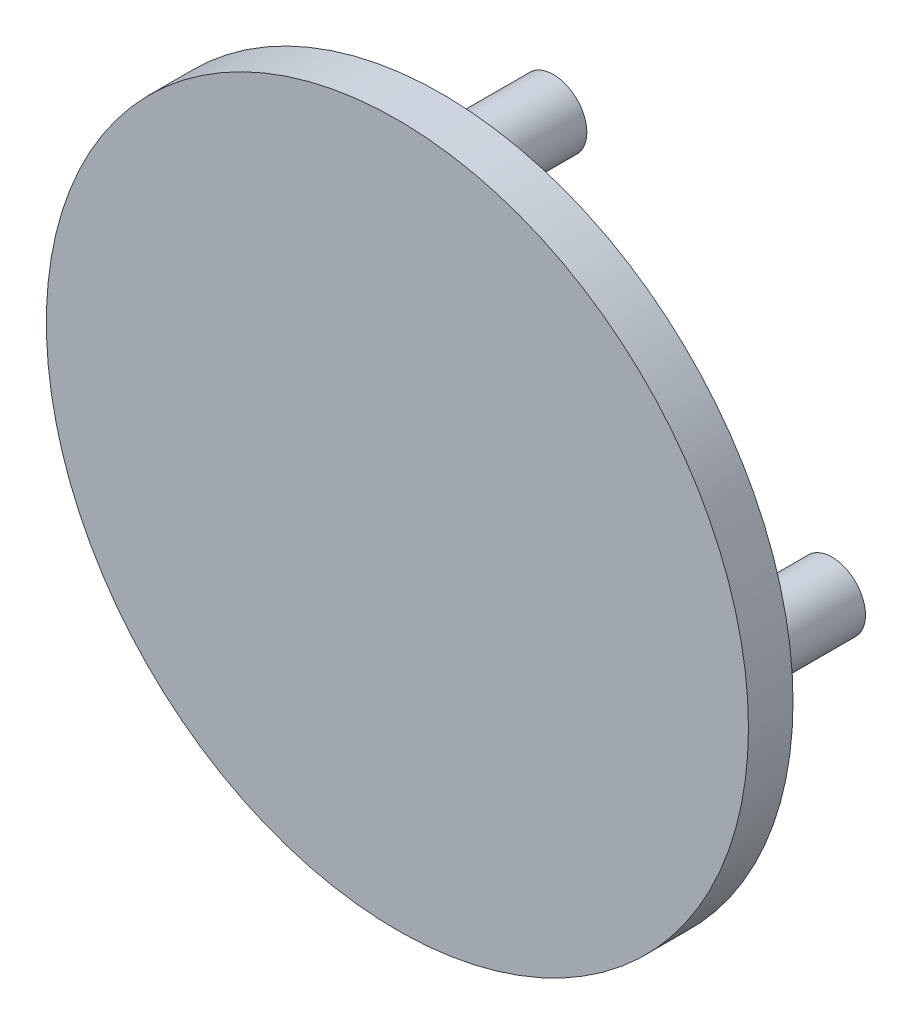
ISO-10303-21;
HEADER;
FILE_DESCRIPTION(('STEP AP214'),'2;1');
FILE_NAME('part.step','',(''),(''),'','','');
FILE_SCHEMA(('AUTOMOTIVE_DESIGN { 1 0 10303 214 1 1 1 1 }'));
ENDSEC;
DATA;
#1=APPLICATION_CONTEXT('core data for automotive mechanical design processes');
#2=APPLICATION_PROTOCOL_DEFINITION('international standard','automotive_design',2000,#1);
#3=PRODUCT_CONTEXT('',#1,'mechanical');
#4=PRODUCT('Part','Part','',(#3));
#5=PRODUCT_RELATED_PRODUCT_CATEGORY('part','',(#4));
#6=PRODUCT_DEFINITION_FORMATION('','',#4);
#7=PRODUCT_DEFINITION_CONTEXT('part definition',#1,'design');
#8=PRODUCT_DEFINITION('design','',#6,#7);
#9=PRODUCT_DEFINITION_SHAPE('','',#8);
#10=(LENGTH_UNIT() NAMED_UNIT(*) SI_UNIT(.MILLI.,.METRE.));
#11=(NAMED_UNIT(*) PLANE_ANGLE_UNIT() SI_UNIT($,.RADIAN.));
#12=(NAMED_UNIT(*) SI_UNIT($,.STERADIAN.) SOLID_ANGLE_UNIT());
#13=UNCERTAINTY_MEASURE_WITH_UNIT(LENGTH_MEASURE(1.E-05),#10,'distance_accuracy_value','');
#14=(GEOMETRIC_REPRESENTATION_CONTEXT(3) GLOBAL_UNCERTAINTY_ASSIGNED_CONTEXT((#13)) GLOBAL_UNIT_ASSIGNED_CONTEXT((#10,
#11,#12)) REPRESENTATION_CONTEXT('',''));
#15=CARTESIAN_POINT('',(0.,0.,0.));
#16=DIRECTION('',(0.,0.,1.));
#17=DIRECTION('',(1.,0.,0.));
#18=AXIS2_PLACEMENT_3D('',#15,#16,#17);
#19=CARTESIAN_POINT('',(0.,0.,8.));
#20=DIRECTION('',(0.,0.,-1.));
#21=DIRECTION('',(-1.,0.,0.));
#22=AXIS2_PLACEMENT_3D('',#19,#20,#21);
#23=CYLINDRICAL_SURFACE('',#22,25.);
#24=CARTESIAN_POINT('',(0.,0.,8.));
#25=DIRECTION('',(0.,0.,1.));
#26=DIRECTION('',(1.,0.,0.));
#27=AXIS2_PLACEMENT_3D('',#24,#25,#26);
#28=CIRCLE('',#27,25.);
#29=CARTESIAN_POINT('',(25.,0.,8.));
#30=VERTEX_POINT('',#29);
#31=EDGE_CURVE('E54',#30,#30,#28,.T.);
#32=ORIENTED_EDGE('',*,*,#31,.F.);
#33=EDGE_LOOP('',(#32));
#34=FACE_BOUND('',#33,.T.);
#35=CARTESIAN_POINT('',(0.,0.,0.));
#36=DIRECTION('',(0.,0.,1.));
#37=DIRECTION('',(1.,0.,0.));
#38=AXIS2_PLACEMENT_3D('',#35,#36,#37);
#39=CIRCLE('',#38,25.);
#40=CARTESIAN_POINT('',(25.,0.,0.));
#41=VERTEX_POINT('',#40);
#42=EDGE_CURVE('E55',#41,#41,#39,.T.);
#43=ORIENTED_EDGE('',*,*,#42,.T.);
#44=EDGE_LOOP('',(#43));
#45=FACE_BOUND('',#44,.T.);
#46=ADVANCED_FACE('F35',(#34,#45),#23,.T.);
#47=CARTESIAN_POINT('',(0.,0.,0.));
#48=DIRECTION('',(0.,0.,1.));
#49=DIRECTION('',(1.,0.,0.));
#50=AXIS2_PLACEMENT_3D('',#47,#48,#49);
#51=PLANE('',#50);
#52=ORIENTED_EDGE('',*,*,#42,.F.);
#53=EDGE_LOOP('',(#52));
#54=FACE_BOUND('',#53,.T.);
#55=ADVANCED_FACE('F94',(#54),#51,.F.);
#56=CARTESIAN_POINT('',(0.,0.,16.));
#57=DIRECTION('',(0.,0.,-1.));
#58=DIRECTION('',(-1.,0.,0.));
#59=AXIS2_PLACEMENT_3D('',#56,#57,#58);
#60=CYLINDRICAL_SURFACE('',#59,63.);
#61=CARTESIAN_POINT('',(0.,0.,16.));
#62=DIRECTION('',(0.,0.,1.));
#63=DIRECTION('',(1.,0.,0.));
#64=AXIS2_PLACEMENT_3D('',#61,#62,#63);
#65=CIRCLE('',#64,63.);
#66=CARTESIAN_POINT('',(63.,0.,16.));
#67=VERTEX_POINT('',#66);
#68=EDGE_CURVE('E58',#67,#67,#65,.T.);
#69=ORIENTED_EDGE('',*,*,#68,.F.);
#70=EDGE_LOOP('',(#69));
#71=FACE_BOUND('',#70,.T.);
#72=CARTESIAN_POINT('',(0.,0.,8.));
#73=DIRECTION('',(0.,0.,1.));
#74=DIRECTION('',(1.,0.,0.));
#75=AXIS2_PLACEMENT_3D('',#72,#73,#74);
#76=CIRCLE('',#75,63.);
#77=CARTESIAN_POINT('',(63.,0.,8.));
#78=VERTEX_POINT('',#77);
#79=EDGE_CURVE('E61',#78,#78,#76,.T.);
#80=ORIENTED_EDGE('',*,*,#79,.T.);
#81=EDGE_LOOP('',(#80));
#82=FACE_BOUND('',#81,.T.);
#83=ADVANCED_FACE('F99',(#71,#82),#60,.T.);
#84=CARTESIAN_POINT('',(0.,0.,16.));
#85=DIRECTION('',(0.,0.,1.));
#86=DIRECTION('',(1.,0.,0.));
#87=AXIS2_PLACEMENT_3D('',#84,#85,#86);
#88=PLANE('',#87);
#89=ORIENTED_EDGE('',*,*,#68,.T.);
#90=EDGE_LOOP('',(#89));
#91=FACE_BOUND('',#90,.T.);
#92=ADVANCED_FACE('F109',(#91),#88,.T.);
#93=CARTESIAN_POINT('',(0.,0.,8.));
#94=DIRECTION('',(0.,0.,1.));
#95=DIRECTION('',(1.,0.,0.));
#96=AXIS2_PLACEMENT_3D('',#93,#94,#95);
#97=PLANE('',#96);
#98=CARTESIAN_POINT('',(49.9999999999986,-1.4210854715202E-12,8.));
#99=DIRECTION('',(0.,0.,1.));
#100=DIRECTION('',(1.,0.,0.));
#101=AXIS2_PLACEMENT_3D('',#98,#99,#100);
#102=CIRCLE('',#101,6.00000000000227);
#103=CARTESIAN_POINT('',(56.0000000000009,-1.4210854715202E-12,8.));
#104=VERTEX_POINT('',#103);
#105=EDGE_CURVE('E10',#104,#104,#102,.F.);
#106=ORIENTED_EDGE('',*,*,#105,.F.);
#107=EDGE_LOOP('',(#106));
#108=FACE_BOUND('',#107,.T.);
#109=CARTESIAN_POINT('',(-2.82992447504893E-12,-50.,8.));
#110=DIRECTION('',(0.,0.,1.));
#111=DIRECTION('',(1.,0.,0.));
#112=AXIS2_PLACEMENT_3D('',#109,#110,#111);
#113=CIRCLE('',#112,6.00000000000304);
#114=CARTESIAN_POINT('',(6.00000000000021,-50.,8.));
#115=VERTEX_POINT('',#114);
#116=EDGE_CURVE('E41',#115,#115,#113,.F.);
#117=ORIENTED_EDGE('',*,*,#116,.F.);
#118=EDGE_LOOP('',(#117));
#119=FACE_BOUND('',#118,.T.);
#120=CARTESIAN_POINT('',(-50.0000000000014,1.41496223752446E-12,8.));
#121=DIRECTION('',(0.,0.,1.));
#122=DIRECTION('',(1.,0.,0.));
#123=AXIS2_PLACEMENT_3D('',#120,#121,#122);
#124=CIRCLE('',#123,6.0000000000011);
#125=CARTESIAN_POINT('',(-44.0000000000003,1.41496223752446E-12,8.));
#126=VERTEX_POINT('',#125);
#127=EDGE_CURVE('E45',#126,#126,#124,.F.);
#128=ORIENTED_EDGE('',*,*,#127,.F.);
#129=EDGE_LOOP('',(#128));
#130=FACE_BOUND('',#129,.T.);
#131=CARTESIAN_POINT('',(0.,50.,8.));
#132=DIRECTION('',(0.,0.,1.));
#133=DIRECTION('',(1.,0.,0.));
#134=AXIS2_PLACEMENT_3D('',#131,#132,#133);
#135=CIRCLE('',#134,6.);
#136=CARTESIAN_POINT('',(6.,50.,8.));
#137=VERTEX_POINT('',#136);
#138=EDGE_CURVE('E49',#137,#137,#135,.F.);
#139=ORIENTED_EDGE('',*,*,#138,.F.);
#140=EDGE_LOOP('',(#139));
#141=FACE_BOUND('',#140,.T.);
#142=ORIENTED_EDGE('',*,*,#31,.T.);
#143=EDGE_LOOP('',(#142));
#144=FACE_BOUND('',#143,.T.);
#145=ORIENTED_EDGE('',*,*,#79,.F.);
#146=EDGE_LOOP('',(#145));
#147=FACE_BOUND('',#146,.T.);
#148=ADVANCED_FACE('F105',(#108,#119,#130,#141,#144,#147),#97,.F.);
#149=CARTESIAN_POINT('',(0.,50.,-12.));
#150=DIRECTION('',(0.,0.,1.));
#151=DIRECTION('',(1.,0.,0.));
#152=AXIS2_PLACEMENT_3D('',#149,#150,#151);
#153=CYLINDRICAL_SURFACE('',#152,6.);
#154=CARTESIAN_POINT('',(0.,50.,-12.));
#155=DIRECTION('',(0.,0.,-1.));
#156=DIRECTION('',(-1.,0.,0.));
#157=AXIS2_PLACEMENT_3D('',#154,#155,#156);
#158=CIRCLE('',#157,6.);
#159=CARTESIAN_POINT('',(-6.,50.,-12.));
#160=VERTEX_POINT('',#159);
#161=EDGE_CURVE('E64',#160,#160,#158,.T.);
#162=ORIENTED_EDGE('',*,*,#161,.F.);
#163=EDGE_LOOP('',(#162));
#164=FACE_BOUND('',#163,.T.);
#165=ORIENTED_EDGE('',*,*,#138,.T.);
#166=EDGE_LOOP('',(#165));
#167=FACE_BOUND('',#166,.T.);
#168=ADVANCED_FACE('F108',(#164,#167),#153,.T.);
#169=CARTESIAN_POINT('',(0.,50.,-12.));
#170=DIRECTION('',(0.,0.,-1.));
#171=DIRECTION('',(-1.,0.,0.));
#172=AXIS2_PLACEMENT_3D('',#169,#170,#171);
#173=PLANE('',#172);
#174=ORIENTED_EDGE('',*,*,#161,.T.);
#175=EDGE_LOOP('',(#174));
#176=FACE_BOUND('',#175,.T.);
#177=ADVANCED_FACE('F126',(#176),#173,.T.);
#178=CARTESIAN_POINT('',(-50.0000000000014,1.41496223752446E-12,-12.));
#179=DIRECTION('',(0.,0.,1.));
#180=DIRECTION('',(1.,0.,0.));
#181=AXIS2_PLACEMENT_3D('',#178,#179,#180);
#182=CYLINDRICAL_SURFACE('',#181,6.0000000000011);
#183=CARTESIAN_POINT('',(-50.0000000000014,1.41496223752446E-12,-12.));
#184=DIRECTION('',(0.,0.,-1.));
#185=DIRECTION('',(-1.,0.,0.));
#186=AXIS2_PLACEMENT_3D('',#183,#184,#185);
#187=CIRCLE('',#186,6.0000000000011);
#188=CARTESIAN_POINT('',(-56.0000000000025,1.41496223752446E-12,-12.));
#189=VERTEX_POINT('',#188);
#190=EDGE_CURVE('E69',#189,#189,#187,.T.);
#191=ORIENTED_EDGE('',*,*,#190,.F.);
#192=EDGE_LOOP('',(#191));
#193=FACE_BOUND('',#192,.T.);
#194=ORIENTED_EDGE('',*,*,#127,.T.);
#195=EDGE_LOOP('',(#194));
#196=FACE_BOUND('',#195,.T.);
#197=ADVANCED_FACE('F130',(#193,#196),#182,.T.);
#198=CARTESIAN_POINT('',(-50.0000000000014,1.41496223752446E-12,-12.));
#199=DIRECTION('',(0.,0.,-1.));
#200=DIRECTION('',(-1.,0.,0.));
#201=AXIS2_PLACEMENT_3D('',#198,#199,#200);
#202=PLANE('',#201);
#203=ORIENTED_EDGE('',*,*,#190,.T.);
#204=EDGE_LOOP('',(#203));
#205=FACE_BOUND('',#204,.T.);
#206=ADVANCED_FACE('F134',(#205),#202,.T.);
#207=CARTESIAN_POINT('',(-2.82992447504893E-12,-50.,-12.));
#208=DIRECTION('',(0.,0.,1.));
#209=DIRECTION('',(1.,0.,0.));
#210=AXIS2_PLACEMENT_3D('',#207,#208,#209);
#211=CYLINDRICAL_SURFACE('',#210,6.00000000000304);
#212=CARTESIAN_POINT('',(-2.82992447504893E-12,-50.,-12.));
#213=DIRECTION('',(0.,0.,-1.));
#214=DIRECTION('',(-1.,0.,0.));
#215=AXIS2_PLACEMENT_3D('',#212,#213,#214);
#216=CIRCLE('',#215,6.00000000000304);
#217=CARTESIAN_POINT('',(-6.00000000000587,-50.,-12.));
#218=VERTEX_POINT('',#217);
#219=EDGE_CURVE('E72',#218,#218,#216,.T.);
#220=ORIENTED_EDGE('',*,*,#219,.F.);
#221=EDGE_LOOP('',(#220));
#222=FACE_BOUND('',#221,.T.);
#223=ORIENTED_EDGE('',*,*,#116,.T.);
#224=EDGE_LOOP('',(#223));
#225=FACE_BOUND('',#224,.T.);
#226=ADVANCED_FACE('F90',(#222,#225),#211,.T.);
#227=CARTESIAN_POINT('',(-2.82992447504893E-12,-50.,-12.));
#228=DIRECTION('',(0.,0.,-1.));
#229=DIRECTION('',(-1.,0.,0.));
#230=AXIS2_PLACEMENT_3D('',#227,#228,#229);
#231=PLANE('',#230);
#232=ORIENTED_EDGE('',*,*,#219,.T.);
#233=EDGE_LOOP('',(#232));
#234=FACE_BOUND('',#233,.T.);
#235=ADVANCED_FACE('F83',(#234),#231,.T.);
#236=CARTESIAN_POINT('',(49.9999999999986,-1.4210854715202E-12,-12.));
#237=DIRECTION('',(0.,0.,1.));
#238=DIRECTION('',(1.,0.,0.));
#239=AXIS2_PLACEMENT_3D('',#236,#237,#238);
#240=CYLINDRICAL_SURFACE('',#239,6.00000000000227);
#241=CARTESIAN_POINT('',(49.9999999999986,-1.4210854715202E-12,-12.));
#242=DIRECTION('',(0.,0.,-1.));
#243=DIRECTION('',(-1.,0.,0.));
#244=AXIS2_PLACEMENT_3D('',#241,#242,#243);
#245=CIRCLE('',#244,6.00000000000227);
#246=CARTESIAN_POINT('',(43.9999999999963,-1.4210854715202E-12,-12.));
#247=VERTEX_POINT('',#246);
#248=EDGE_CURVE('E75',#247,#247,#245,.T.);
#249=ORIENTED_EDGE('',*,*,#248,.F.);
#250=EDGE_LOOP('',(#249));
#251=FACE_BOUND('',#250,.T.);
#252=ORIENTED_EDGE('',*,*,#105,.T.);
#253=EDGE_LOOP('',(#252));
#254=FACE_BOUND('',#253,.T.);
#255=ADVANCED_FACE('F81',(#251,#254),#240,.T.);
#256=CARTESIAN_POINT('',(49.9999999999986,-1.4210854715202E-12,-12.));
#257=DIRECTION('',(0.,0.,-1.));
#258=DIRECTION('',(-1.,0.,0.));
#259=AXIS2_PLACEMENT_3D('',#256,#257,#258);
#260=PLANE('',#259);
#261=ORIENTED_EDGE('',*,*,#248,.T.);
#262=EDGE_LOOP('',(#261));
#263=FACE_BOUND('',#262,.T.);
#264=ADVANCED_FACE('F79',(#263),#260,.T.);
#265=CLOSED_SHELL('',(#46,#55,#83,#92,#148,#168,#177,#197,#206,#226,#235,#255,#264));
#266=MANIFOLD_SOLID_BREP('B2',#265);
#267=ADVANCED_BREP_SHAPE_REPRESENTATION('',(#18,#266),#14);
#268=SHAPE_DEFINITION_REPRESENTATION(#9,#267);
ENDSEC;
END-ISO-10303-21;
